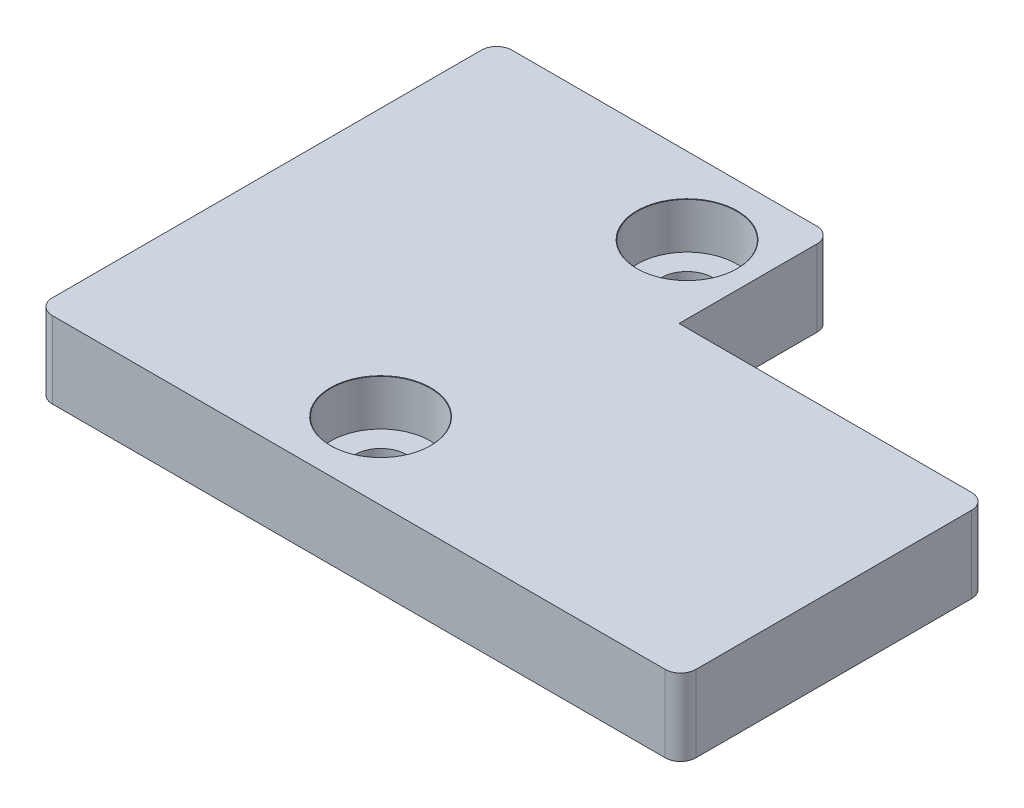
ISO-10303-21;
HEADER;
FILE_DESCRIPTION(('STEP AP214'),'2;1');
FILE_NAME('part.step','',(''),(''),'','','');
FILE_SCHEMA(('AUTOMOTIVE_DESIGN { 1 0 10303 214 1 1 1 1 }'));
ENDSEC;
DATA;
#1=APPLICATION_CONTEXT('core data for automotive mechanical design processes');
#2=APPLICATION_PROTOCOL_DEFINITION('international standard','automotive_design',2000,#1);
#3=PRODUCT_CONTEXT('',#1,'mechanical');
#4=PRODUCT('Part','Part','',(#3));
#5=PRODUCT_RELATED_PRODUCT_CATEGORY('part','',(#4));
#6=PRODUCT_DEFINITION_FORMATION('','',#4);
#7=PRODUCT_DEFINITION_CONTEXT('part definition',#1,'design');
#8=PRODUCT_DEFINITION('design','',#6,#7);
#9=PRODUCT_DEFINITION_SHAPE('','',#8);
#10=(LENGTH_UNIT() NAMED_UNIT(*) SI_UNIT(.MILLI.,.METRE.));
#11=(NAMED_UNIT(*) PLANE_ANGLE_UNIT() SI_UNIT($,.RADIAN.));
#12=(NAMED_UNIT(*) SI_UNIT($,.STERADIAN.) SOLID_ANGLE_UNIT());
#13=UNCERTAINTY_MEASURE_WITH_UNIT(LENGTH_MEASURE(1.E-05),#10,'distance_accuracy_value','');
#14=(GEOMETRIC_REPRESENTATION_CONTEXT(3) GLOBAL_UNCERTAINTY_ASSIGNED_CONTEXT((#13)) GLOBAL_UNIT_ASSIGNED_CONTEXT((#10,
#11,#12)) REPRESENTATION_CONTEXT('',''));
#15=CARTESIAN_POINT('',(0.,0.,0.));
#16=DIRECTION('',(0.,0.,1.));
#17=DIRECTION('',(1.,0.,0.));
#18=AXIS2_PLACEMENT_3D('',#15,#16,#17);
#19=CARTESIAN_POINT('',(-21.,5.,-10.));
#20=DIRECTION('',(1.,0.,0.));
#21=DIRECTION('',(0.,0.,-1.));
#22=AXIS2_PLACEMENT_3D('',#19,#20,#21);
#23=PLANE('',#22);
#24=DIRECTION('',(0.,0.,1.));
#25=VECTOR('',#24,1.);
#26=CARTESIAN_POINT('',(-21.,5.,-10.));
#27=LINE('',#26,#25);
#28=CARTESIAN_POINT('',(-21.,5.,-19.));
#29=VERTEX_POINT('',#28);
#30=CARTESIAN_POINT('',(-21.,5.,9.));
#31=VERTEX_POINT('',#30);
#32=EDGE_CURVE('E138',#29,#31,#27,.T.);
#33=ORIENTED_EDGE('',*,*,#32,.F.);
#34=DIRECTION('',(0.,1.,0.));
#35=VECTOR('',#34,1.);
#36=CARTESIAN_POINT('',(-21.,0.,-19.));
#37=LINE('',#36,#35);
#38=CARTESIAN_POINT('',(-21.,0.,-19.));
#39=VERTEX_POINT('',#38);
#40=EDGE_CURVE('E222',#29,#39,#37,.F.);
#41=ORIENTED_EDGE('',*,*,#40,.T.);
#42=DIRECTION('',(0.,0.,1.));
#43=VECTOR('',#42,1.);
#44=CARTESIAN_POINT('',(-21.,0.,-10.));
#45=LINE('',#44,#43);
#46=CARTESIAN_POINT('',(-21.,0.,9.));
#47=VERTEX_POINT('',#46);
#48=EDGE_CURVE('E151',#39,#47,#45,.T.);
#49=ORIENTED_EDGE('',*,*,#48,.T.);
#50=DIRECTION('',(0.,-1.,0.));
#51=VECTOR('',#50,1.);
#52=CARTESIAN_POINT('',(-21.,5.,9.));
#53=LINE('',#52,#51);
#54=EDGE_CURVE('E219',#47,#31,#53,.F.);
#55=ORIENTED_EDGE('',*,*,#54,.T.);
#56=EDGE_LOOP('',(#33,#41,#49,#55));
#57=FACE_BOUND('',#56,.T.);
#58=ADVANCED_FACE('F43',(#57),#23,.F.);
#59=CARTESIAN_POINT('',(21.,5.,10.));
#60=DIRECTION('',(0.,0.,-1.));
#61=DIRECTION('',(-1.,0.,0.));
#62=AXIS2_PLACEMENT_3D('',#59,#60,#61);
#63=PLANE('',#62);
#64=DIRECTION('',(1.,0.,0.));
#65=VECTOR('',#64,1.);
#66=CARTESIAN_POINT('',(21.,0.,10.));
#67=LINE('',#66,#65);
#68=CARTESIAN_POINT('',(-20.,0.,10.));
#69=VERTEX_POINT('',#68);
#70=CARTESIAN_POINT('',(20.,0.,10.));
#71=VERTEX_POINT('',#70);
#72=EDGE_CURVE('E192',#69,#71,#67,.T.);
#73=ORIENTED_EDGE('',*,*,#72,.T.);
#74=DIRECTION('',(0.,-1.,0.));
#75=VECTOR('',#74,1.);
#76=CARTESIAN_POINT('',(20.,5.,10.));
#77=LINE('',#76,#75);
#78=CARTESIAN_POINT('',(20.,5.,10.));
#79=VERTEX_POINT('',#78);
#80=EDGE_CURVE('E11',#71,#79,#77,.F.);
#81=ORIENTED_EDGE('',*,*,#80,.T.);
#82=DIRECTION('',(1.,0.,0.));
#83=VECTOR('',#82,1.);
#84=CARTESIAN_POINT('',(21.,5.,10.));
#85=LINE('',#84,#83);
#86=CARTESIAN_POINT('',(-20.,5.,10.));
#87=VERTEX_POINT('',#86);
#88=EDGE_CURVE('E177',#87,#79,#85,.T.);
#89=ORIENTED_EDGE('',*,*,#88,.F.);
#90=DIRECTION('',(0.,-1.,0.));
#91=VECTOR('',#90,1.);
#92=CARTESIAN_POINT('',(-20.,5.,10.));
#93=LINE('',#92,#91);
#94=EDGE_CURVE('E52',#87,#69,#93,.T.);
#95=ORIENTED_EDGE('',*,*,#94,.T.);
#96=EDGE_LOOP('',(#73,#81,#89,#95));
#97=FACE_BOUND('',#96,.T.);
#98=ADVANCED_FACE('F251',(#97),#63,.F.);
#99=CARTESIAN_POINT('',(21.,5.,-10.));
#100=DIRECTION('',(-1.,0.,0.));
#101=DIRECTION('',(0.,0.,1.));
#102=AXIS2_PLACEMENT_3D('',#99,#100,#101);
#103=PLANE('',#102);
#104=DIRECTION('',(0.,0.,-1.));
#105=VECTOR('',#104,1.);
#106=CARTESIAN_POINT('',(21.,0.,-10.));
#107=LINE('',#106,#105);
#108=CARTESIAN_POINT('',(21.,0.,9.));
#109=VERTEX_POINT('',#108);
#110=CARTESIAN_POINT('',(21.,0.,-9.));
#111=VERTEX_POINT('',#110);
#112=EDGE_CURVE('E139',#109,#111,#107,.T.);
#113=ORIENTED_EDGE('',*,*,#112,.T.);
#114=DIRECTION('',(0.,-1.,0.));
#115=VECTOR('',#114,1.);
#116=CARTESIAN_POINT('',(21.,5.,-9.));
#117=LINE('',#116,#115);
#118=CARTESIAN_POINT('',(21.,5.,-9.));
#119=VERTEX_POINT('',#118);
#120=EDGE_CURVE('E246',#111,#119,#117,.F.);
#121=ORIENTED_EDGE('',*,*,#120,.T.);
#122=DIRECTION('',(0.,0.,-1.));
#123=VECTOR('',#122,1.);
#124=CARTESIAN_POINT('',(21.,5.,-10.));
#125=LINE('',#124,#123);
#126=CARTESIAN_POINT('',(21.,5.,9.));
#127=VERTEX_POINT('',#126);
#128=EDGE_CURVE('E181',#127,#119,#125,.T.);
#129=ORIENTED_EDGE('',*,*,#128,.F.);
#130=DIRECTION('',(0.,-1.,0.));
#131=VECTOR('',#130,1.);
#132=CARTESIAN_POINT('',(21.,5.,9.));
#133=LINE('',#132,#131);
#134=EDGE_CURVE('E242',#127,#109,#133,.T.);
#135=ORIENTED_EDGE('',*,*,#134,.T.);
#136=EDGE_LOOP('',(#113,#121,#129,#135));
#137=FACE_BOUND('',#136,.T.);
#138=ADVANCED_FACE('F275',(#137),#103,.F.);
#139=CARTESIAN_POINT('',(21.,5.,-10.));
#140=DIRECTION('',(0.,0.,1.));
#141=DIRECTION('',(1.,0.,0.));
#142=AXIS2_PLACEMENT_3D('',#139,#140,#141);
#143=PLANE('',#142);
#144=DIRECTION('',(-1.,0.,0.));
#145=VECTOR('',#144,1.);
#146=CARTESIAN_POINT('',(21.,5.,-10.));
#147=LINE('',#146,#145);
#148=CARTESIAN_POINT('',(20.,5.,-10.));
#149=VERTEX_POINT('',#148);
#150=CARTESIAN_POINT('',(0.900000000000001,5.,-10.));
#151=VERTEX_POINT('',#150);
#152=EDGE_CURVE('E185',#149,#151,#147,.T.);
#153=ORIENTED_EDGE('',*,*,#152,.F.);
#154=DIRECTION('',(0.,-1.,0.));
#155=VECTOR('',#154,1.);
#156=CARTESIAN_POINT('',(20.,5.,-10.));
#157=LINE('',#156,#155);
#158=CARTESIAN_POINT('',(20.,0.,-10.));
#159=VERTEX_POINT('',#158);
#160=EDGE_CURVE('E135',#149,#159,#157,.T.);
#161=ORIENTED_EDGE('',*,*,#160,.T.);
#162=DIRECTION('',(-1.,0.,0.));
#163=VECTOR('',#162,1.);
#164=CARTESIAN_POINT('',(21.,0.,-10.));
#165=LINE('',#164,#163);
#166=CARTESIAN_POINT('',(0.900000000000001,0.,-10.));
#167=VERTEX_POINT('',#166);
#168=EDGE_CURVE('E129',#159,#167,#165,.T.);
#169=ORIENTED_EDGE('',*,*,#168,.T.);
#170=DIRECTION('',(0.,1.,0.));
#171=VECTOR('',#170,1.);
#172=CARTESIAN_POINT('',(0.900000000000001,0.,-10.));
#173=LINE('',#172,#171);
#174=EDGE_CURVE('E133',#167,#151,#173,.T.);
#175=ORIENTED_EDGE('',*,*,#174,.T.);
#176=EDGE_LOOP('',(#153,#161,#169,#175));
#177=FACE_BOUND('',#176,.T.);
#178=ADVANCED_FACE('F132',(#177),#143,.F.);
#179=CARTESIAN_POINT('',(0.,5.,0.));
#180=DIRECTION('',(0.,-1.,0.));
#181=DIRECTION('',(0.,0.,-1.));
#182=AXIS2_PLACEMENT_3D('',#179,#180,#181);
#183=PLANE('',#182);
#184=CARTESIAN_POINT('',(-3.575,5.,-15.));
#185=DIRECTION('',(0.,1.,0.));
#186=DIRECTION('',(0.,0.,1.));
#187=AXIS2_PLACEMENT_3D('',#184,#185,#186);
#188=CIRCLE('',#187,3.275);
#189=CARTESIAN_POINT('',(-3.575,5.,-11.725));
#190=VERTEX_POINT('',#189);
#191=EDGE_CURVE('E518',#190,#190,#188,.T.);
#192=ORIENTED_EDGE('',*,*,#191,.F.);
#193=EDGE_LOOP('',(#192));
#194=FACE_BOUND('',#193,.T.);
#195=CARTESIAN_POINT('',(-3.57499999999999,5.,5.));
#196=DIRECTION('',(0.,1.,0.));
#197=DIRECTION('',(0.,0.,1.));
#198=AXIS2_PLACEMENT_3D('',#195,#196,#197);
#199=CIRCLE('',#198,3.275);
#200=CARTESIAN_POINT('',(-3.57499999999999,5.,8.275));
#201=VERTEX_POINT('',#200);
#202=EDGE_CURVE('E521',#201,#201,#199,.T.);
#203=ORIENTED_EDGE('',*,*,#202,.F.);
#204=EDGE_LOOP('',(#203));
#205=FACE_BOUND('',#204,.T.);
#206=DIRECTION('',(-1.,0.,0.));
#207=VECTOR('',#206,1.);
#208=CARTESIAN_POINT('',(-21.,5.,-20.));
#209=LINE('',#208,#207);
#210=CARTESIAN_POINT('',(-0.0999999999999994,5.,-20.));
#211=VERTEX_POINT('',#210);
#212=CARTESIAN_POINT('',(-20.,5.,-20.));
#213=VERTEX_POINT('',#212);
#214=EDGE_CURVE('E160',#211,#213,#209,.T.);
#215=ORIENTED_EDGE('',*,*,#214,.T.);
#216=CARTESIAN_POINT('',(-20.,5.,-19.));
#217=DIRECTION('',(0.,-1.,0.));
#218=DIRECTION('',(0.,0.,-1.));
#219=AXIS2_PLACEMENT_3D('',#216,#217,#218);
#220=CIRCLE('',#219,1.);
#221=EDGE_CURVE('E216',#213,#29,#220,.F.);
#222=ORIENTED_EDGE('',*,*,#221,.T.);
#223=ORIENTED_EDGE('',*,*,#32,.T.);
#224=CARTESIAN_POINT('',(-20.,5.,9.));
#225=DIRECTION('',(0.,-1.,0.));
#226=DIRECTION('',(0.,0.,-1.));
#227=AXIS2_PLACEMENT_3D('',#224,#225,#226);
#228=CIRCLE('',#227,1.);
#229=EDGE_CURVE('E204',#31,#87,#228,.F.);
#230=ORIENTED_EDGE('',*,*,#229,.T.);
#231=ORIENTED_EDGE('',*,*,#88,.T.);
#232=CARTESIAN_POINT('',(20.,5.,9.));
#233=DIRECTION('',(0.,-1.,0.));
#234=DIRECTION('',(0.,0.,-1.));
#235=AXIS2_PLACEMENT_3D('',#232,#233,#234);
#236=CIRCLE('',#235,1.);
#237=EDGE_CURVE('E207',#79,#127,#236,.F.);
#238=ORIENTED_EDGE('',*,*,#237,.T.);
#239=ORIENTED_EDGE('',*,*,#128,.T.);
#240=CARTESIAN_POINT('',(20.,5.,-9.));
#241=DIRECTION('',(0.,-1.,0.));
#242=DIRECTION('',(0.,0.,-1.));
#243=AXIS2_PLACEMENT_3D('',#240,#241,#242);
#244=CIRCLE('',#243,1.);
#245=EDGE_CURVE('E210',#119,#149,#244,.F.);
#246=ORIENTED_EDGE('',*,*,#245,.T.);
#247=ORIENTED_EDGE('',*,*,#152,.T.);
#248=DIRECTION('',(0.,0.,-1.));
#249=VECTOR('',#248,1.);
#250=CARTESIAN_POINT('',(0.900000000000001,5.,-10.));
#251=LINE('',#250,#249);
#252=CARTESIAN_POINT('',(0.900000000000001,5.,-19.));
#253=VERTEX_POINT('',#252);
#254=EDGE_CURVE('E149',#151,#253,#251,.T.);
#255=ORIENTED_EDGE('',*,*,#254,.T.);
#256=CARTESIAN_POINT('',(-0.0999999999999985,5.,-19.));
#257=DIRECTION('',(0.,-1.,0.));
#258=DIRECTION('',(0.,0.,-1.));
#259=AXIS2_PLACEMENT_3D('',#256,#257,#258);
#260=CIRCLE('',#259,1.);
#261=EDGE_CURVE('E213',#253,#211,#260,.F.);
#262=ORIENTED_EDGE('',*,*,#261,.T.);
#263=EDGE_LOOP('',(#215,#222,#223,#230,#231,#238,#239,#246,#247,#255,#262));
#264=FACE_BOUND('',#263,.T.);
#265=ADVANCED_FACE('F259',(#194,#205,#264),#183,.F.);
#266=CARTESIAN_POINT('',(0.,0.,0.));
#267=DIRECTION('',(0.,-1.,0.));
#268=DIRECTION('',(0.,0.,-1.));
#269=AXIS2_PLACEMENT_3D('',#266,#267,#268);
#270=PLANE('',#269);
#271=CARTESIAN_POINT('',(-3.575,0.,-15.));
#272=DIRECTION('',(0.,1.,0.));
#273=DIRECTION('',(0.,0.,1.));
#274=AXIS2_PLACEMENT_3D('',#271,#272,#273);
#275=CIRCLE('',#274,1.7);
#276=CARTESIAN_POINT('',(-3.575,0.,-13.3));
#277=VERTEX_POINT('',#276);
#278=EDGE_CURVE('E525',#277,#277,#275,.T.);
#279=ORIENTED_EDGE('',*,*,#278,.T.);
#280=EDGE_LOOP('',(#279));
#281=FACE_BOUND('',#280,.T.);
#282=CARTESIAN_POINT('',(-3.57499999999999,0.,5.));
#283=DIRECTION('',(0.,1.,0.));
#284=DIRECTION('',(0.,0.,1.));
#285=AXIS2_PLACEMENT_3D('',#282,#283,#284);
#286=CIRCLE('',#285,1.7);
#287=CARTESIAN_POINT('',(-3.57499999999999,0.,6.7));
#288=VERTEX_POINT('',#287);
#289=EDGE_CURVE('E169',#288,#288,#286,.T.);
#290=ORIENTED_EDGE('',*,*,#289,.T.);
#291=EDGE_LOOP('',(#290));
#292=FACE_BOUND('',#291,.T.);
#293=ORIENTED_EDGE('',*,*,#48,.F.);
#294=CARTESIAN_POINT('',(-20.,0.,-19.));
#295=DIRECTION('',(0.,-1.,0.));
#296=DIRECTION('',(0.,0.,-1.));
#297=AXIS2_PLACEMENT_3D('',#294,#295,#296);
#298=CIRCLE('',#297,1.);
#299=CARTESIAN_POINT('',(-20.,0.,-20.));
#300=VERTEX_POINT('',#299);
#301=EDGE_CURVE('E234',#39,#300,#298,.T.);
#302=ORIENTED_EDGE('',*,*,#301,.T.);
#303=DIRECTION('',(-1.,0.,0.));
#304=VECTOR('',#303,1.);
#305=CARTESIAN_POINT('',(-21.,0.,-20.));
#306=LINE('',#305,#304);
#307=CARTESIAN_POINT('',(-0.0999999999999994,0.,-20.));
#308=VERTEX_POINT('',#307);
#309=EDGE_CURVE('E152',#308,#300,#306,.T.);
#310=ORIENTED_EDGE('',*,*,#309,.F.);
#311=CARTESIAN_POINT('',(-0.0999999999999985,0.,-19.));
#312=DIRECTION('',(0.,-1.,0.));
#313=DIRECTION('',(0.,0.,-1.));
#314=AXIS2_PLACEMENT_3D('',#311,#312,#313);
#315=CIRCLE('',#314,1.);
#316=CARTESIAN_POINT('',(0.900000000000001,0.,-19.));
#317=VERTEX_POINT('',#316);
#318=EDGE_CURVE('E158',#308,#317,#315,.T.);
#319=ORIENTED_EDGE('',*,*,#318,.T.);
#320=DIRECTION('',(0.,0.,-1.));
#321=VECTOR('',#320,1.);
#322=CARTESIAN_POINT('',(0.900000000000001,0.,-10.));
#323=LINE('',#322,#321);
#324=EDGE_CURVE('E146',#167,#317,#323,.T.);
#325=ORIENTED_EDGE('',*,*,#324,.F.);
#326=ORIENTED_EDGE('',*,*,#168,.F.);
#327=CARTESIAN_POINT('',(20.,0.,-9.));
#328=DIRECTION('',(0.,-1.,0.));
#329=DIRECTION('',(0.,0.,-1.));
#330=AXIS2_PLACEMENT_3D('',#327,#328,#329);
#331=CIRCLE('',#330,1.);
#332=EDGE_CURVE('E229',#159,#111,#331,.T.);
#333=ORIENTED_EDGE('',*,*,#332,.T.);
#334=ORIENTED_EDGE('',*,*,#112,.F.);
#335=CARTESIAN_POINT('',(20.,0.,9.));
#336=DIRECTION('',(0.,-1.,0.));
#337=DIRECTION('',(0.,0.,-1.));
#338=AXIS2_PLACEMENT_3D('',#335,#336,#337);
#339=CIRCLE('',#338,1.);
#340=EDGE_CURVE('E59',#109,#71,#339,.T.);
#341=ORIENTED_EDGE('',*,*,#340,.T.);
#342=ORIENTED_EDGE('',*,*,#72,.F.);
#343=CARTESIAN_POINT('',(-20.,0.,9.));
#344=DIRECTION('',(0.,-1.,0.));
#345=DIRECTION('',(0.,0.,-1.));
#346=AXIS2_PLACEMENT_3D('',#343,#344,#345);
#347=CIRCLE('',#346,1.);
#348=EDGE_CURVE('E67',#69,#47,#347,.T.);
#349=ORIENTED_EDGE('',*,*,#348,.T.);
#350=EDGE_LOOP('',(#293,#302,#310,#319,#325,#326,#333,#334,#341,#342,#349));
#351=FACE_BOUND('',#350,.T.);
#352=ADVANCED_FACE('F155',(#281,#292,#351),#270,.T.);
#353=CARTESIAN_POINT('',(-21.,0.,-20.));
#354=DIRECTION('',(0.,0.,-1.));
#355=DIRECTION('',(-1.,0.,0.));
#356=AXIS2_PLACEMENT_3D('',#353,#354,#355);
#357=PLANE('',#356);
#358=ORIENTED_EDGE('',*,*,#309,.T.);
#359=DIRECTION('',(0.,1.,0.));
#360=VECTOR('',#359,1.);
#361=CARTESIAN_POINT('',(-20.,5.,-20.));
#362=LINE('',#361,#360);
#363=EDGE_CURVE('E200',#300,#213,#362,.T.);
#364=ORIENTED_EDGE('',*,*,#363,.T.);
#365=ORIENTED_EDGE('',*,*,#214,.F.);
#366=DIRECTION('',(0.,1.,0.));
#367=VECTOR('',#366,1.);
#368=CARTESIAN_POINT('',(-0.0999999999999994,0.,-20.));
#369=LINE('',#368,#367);
#370=EDGE_CURVE('E188',#211,#308,#369,.F.);
#371=ORIENTED_EDGE('',*,*,#370,.T.);
#372=EDGE_LOOP('',(#358,#364,#365,#371));
#373=FACE_BOUND('',#372,.T.);
#374=ADVANCED_FACE('F265',(#373),#357,.T.);
#375=CARTESIAN_POINT('',(0.900000000000001,0.,-10.));
#376=DIRECTION('',(1.,0.,0.));
#377=DIRECTION('',(0.,0.,-1.));
#378=AXIS2_PLACEMENT_3D('',#375,#376,#377);
#379=PLANE('',#378);
#380=ORIENTED_EDGE('',*,*,#324,.T.);
#381=DIRECTION('',(0.,1.,0.));
#382=VECTOR('',#381,1.);
#383=CARTESIAN_POINT('',(0.900000000000001,0.,-19.));
#384=LINE('',#383,#382);
#385=EDGE_CURVE('E237',#317,#253,#384,.T.);
#386=ORIENTED_EDGE('',*,*,#385,.T.);
#387=ORIENTED_EDGE('',*,*,#254,.F.);
#388=ORIENTED_EDGE('',*,*,#174,.F.);
#389=EDGE_LOOP('',(#380,#386,#387,#388));
#390=FACE_BOUND('',#389,.T.);
#391=ADVANCED_FACE('F144',(#390),#379,.T.);
#392=CARTESIAN_POINT('',(-3.57499999999999,5.,5.));
#393=DIRECTION('',(0.,1.,0.));
#394=DIRECTION('',(0.,0.,1.));
#395=AXIS2_PLACEMENT_3D('',#392,#393,#394);
#396=CYLINDRICAL_SURFACE('',#395,1.7);
#397=ORIENTED_EDGE('',*,*,#289,.F.);
#398=EDGE_LOOP('',(#397));
#399=FACE_BOUND('',#398,.T.);
#400=CARTESIAN_POINT('',(-3.57499999999999,2.,5.));
#401=DIRECTION('',(0.,1.,0.));
#402=DIRECTION('',(0.,0.,1.));
#403=AXIS2_PLACEMENT_3D('',#400,#401,#402);
#404=CIRCLE('',#403,1.7);
#405=CARTESIAN_POINT('',(-3.57499999999999,2.,6.7));
#406=VERTEX_POINT('',#405);
#407=EDGE_CURVE('E539',#406,#406,#404,.T.);
#408=ORIENTED_EDGE('',*,*,#407,.T.);
#409=EDGE_LOOP('',(#408));
#410=FACE_BOUND('',#409,.T.);
#411=ADVANCED_FACE('F400',(#399,#410),#396,.F.);
#412=CARTESIAN_POINT('',(-0.324999999999995,2.,5.));
#413=DIRECTION('',(0.,-1.,0.));
#414=DIRECTION('',(0.,0.,-1.));
#415=AXIS2_PLACEMENT_3D('',#412,#413,#414);
#416=PLANE('',#415);
#417=ORIENTED_EDGE('',*,*,#407,.F.);
#418=EDGE_LOOP('',(#417));
#419=FACE_BOUND('',#418,.T.);
#420=CARTESIAN_POINT('',(-3.57499999999999,2.,5.));
#421=DIRECTION('',(0.,1.,0.));
#422=DIRECTION('',(0.,0.,1.));
#423=AXIS2_PLACEMENT_3D('',#420,#421,#422);
#424=CIRCLE('',#423,3.25);
#425=CARTESIAN_POINT('',(-3.57499999999999,2.,8.25));
#426=VERTEX_POINT('',#425);
#427=EDGE_CURVE('E530',#426,#426,#424,.T.);
#428=ORIENTED_EDGE('',*,*,#427,.T.);
#429=EDGE_LOOP('',(#428));
#430=FACE_BOUND('',#429,.T.);
#431=ADVANCED_FACE('F390',(#419,#430),#416,.F.);
#432=CARTESIAN_POINT('',(-3.57499999999999,5.,5.));
#433=DIRECTION('',(0.,1.,0.));
#434=DIRECTION('',(0.,0.,1.));
#435=AXIS2_PLACEMENT_3D('',#432,#433,#434);
#436=CYLINDRICAL_SURFACE('',#435,3.25);
#437=ORIENTED_EDGE('',*,*,#427,.F.);
#438=EDGE_LOOP('',(#437));
#439=FACE_BOUND('',#438,.T.);
#440=CARTESIAN_POINT('',(-3.57499999999999,4.97902250922057,5.));
#441=DIRECTION('',(0.,1.,0.));
#442=DIRECTION('',(0.,0.,1.));
#443=AXIS2_PLACEMENT_3D('',#440,#441,#442);
#444=CIRCLE('',#443,3.25);
#445=CARTESIAN_POINT('',(-3.57499999999999,4.97902250922057,8.25));
#446=VERTEX_POINT('',#445);
#447=EDGE_CURVE('E524',#446,#446,#444,.T.);
#448=ORIENTED_EDGE('',*,*,#447,.T.);
#449=EDGE_LOOP('',(#448));
#450=FACE_BOUND('',#449,.T.);
#451=ADVANCED_FACE('F380',(#439,#450),#436,.F.);
#452=CARTESIAN_POINT('',(-3.57499999999999,5.,5.));
#453=DIRECTION('',(0.,1.,0.));
#454=DIRECTION('',(0.,0.,1.));
#455=AXIS2_PLACEMENT_3D('',#452,#453,#454);
#456=CONICAL_SURFACE('',#455,3.275,0.87266462599717);
#457=ORIENTED_EDGE('',*,*,#447,.F.);
#458=EDGE_LOOP('',(#457));
#459=FACE_BOUND('',#458,.T.);
#460=ORIENTED_EDGE('',*,*,#202,.T.);
#461=EDGE_LOOP('',(#460));
#462=FACE_BOUND('',#461,.T.);
#463=ADVANCED_FACE('F370',(#459,#462),#456,.F.);
#464=CARTESIAN_POINT('',(-3.575,5.,-15.));
#465=DIRECTION('',(0.,1.,0.));
#466=DIRECTION('',(0.,0.,1.));
#467=AXIS2_PLACEMENT_3D('',#464,#465,#466);
#468=CYLINDRICAL_SURFACE('',#467,1.7);
#469=ORIENTED_EDGE('',*,*,#278,.F.);
#470=EDGE_LOOP('',(#469));
#471=FACE_BOUND('',#470,.T.);
#472=CARTESIAN_POINT('',(-3.575,2.,-15.));
#473=DIRECTION('',(0.,1.,0.));
#474=DIRECTION('',(0.,0.,1.));
#475=AXIS2_PLACEMENT_3D('',#472,#473,#474);
#476=CIRCLE('',#475,1.7);
#477=CARTESIAN_POINT('',(-3.575,2.,-13.3));
#478=VERTEX_POINT('',#477);
#479=EDGE_CURVE('E533',#478,#478,#476,.T.);
#480=ORIENTED_EDGE('',*,*,#479,.T.);
#481=EDGE_LOOP('',(#480));
#482=FACE_BOUND('',#481,.T.);
#483=ADVANCED_FACE('F360',(#471,#482),#468,.F.);
#484=CARTESIAN_POINT('',(-0.325000000000001,2.,-15.));
#485=DIRECTION('',(0.,-1.,0.));
#486=DIRECTION('',(0.,0.,-1.));
#487=AXIS2_PLACEMENT_3D('',#484,#485,#486);
#488=PLANE('',#487);
#489=ORIENTED_EDGE('',*,*,#479,.F.);
#490=EDGE_LOOP('',(#489));
#491=FACE_BOUND('',#490,.T.);
#492=CARTESIAN_POINT('',(-3.575,2.,-15.));
#493=DIRECTION('',(0.,1.,0.));
#494=DIRECTION('',(0.,0.,1.));
#495=AXIS2_PLACEMENT_3D('',#492,#493,#494);
#496=CIRCLE('',#495,3.25);
#497=CARTESIAN_POINT('',(-3.575,2.,-11.75));
#498=VERTEX_POINT('',#497);
#499=EDGE_CURVE('E555',#498,#498,#496,.T.);
#500=ORIENTED_EDGE('',*,*,#499,.T.);
#501=EDGE_LOOP('',(#500));
#502=FACE_BOUND('',#501,.T.);
#503=ADVANCED_FACE('F350',(#491,#502),#488,.F.);
#504=CARTESIAN_POINT('',(-3.575,5.,-15.));
#505=DIRECTION('',(0.,1.,0.));
#506=DIRECTION('',(0.,0.,1.));
#507=AXIS2_PLACEMENT_3D('',#504,#505,#506);
#508=CYLINDRICAL_SURFACE('',#507,3.25);
#509=ORIENTED_EDGE('',*,*,#499,.F.);
#510=EDGE_LOOP('',(#509));
#511=FACE_BOUND('',#510,.T.);
#512=CARTESIAN_POINT('',(-3.575,4.97902250922057,-15.));
#513=DIRECTION('',(0.,1.,0.));
#514=DIRECTION('',(0.,0.,1.));
#515=AXIS2_PLACEMENT_3D('',#512,#513,#514);
#516=CIRCLE('',#515,3.25);
#517=CARTESIAN_POINT('',(-3.575,4.97902250922057,-11.75));
#518=VERTEX_POINT('',#517);
#519=EDGE_CURVE('E559',#518,#518,#516,.T.);
#520=ORIENTED_EDGE('',*,*,#519,.T.);
#521=EDGE_LOOP('',(#520));
#522=FACE_BOUND('',#521,.T.);
#523=ADVANCED_FACE('F340',(#511,#522),#508,.F.);
#524=CARTESIAN_POINT('',(-3.575,5.,-15.));
#525=DIRECTION('',(0.,1.,0.));
#526=DIRECTION('',(0.,0.,1.));
#527=AXIS2_PLACEMENT_3D('',#524,#525,#526);
#528=CONICAL_SURFACE('',#527,3.275,0.87266462599717);
#529=ORIENTED_EDGE('',*,*,#519,.F.);
#530=EDGE_LOOP('',(#529));
#531=FACE_BOUND('',#530,.T.);
#532=ORIENTED_EDGE('',*,*,#191,.T.);
#533=EDGE_LOOP('',(#532));
#534=FACE_BOUND('',#533,.T.);
#535=ADVANCED_FACE('F296',(#531,#534),#528,.F.);
#536=CARTESIAN_POINT('',(-20.,0.,-19.));
#537=DIRECTION('',(0.,-1.,0.));
#538=DIRECTION('',(0.,0.,-1.));
#539=AXIS2_PLACEMENT_3D('',#536,#537,#538);
#540=CYLINDRICAL_SURFACE('',#539,1.);
#541=ORIENTED_EDGE('',*,*,#301,.F.);
#542=ORIENTED_EDGE('',*,*,#40,.F.);
#543=ORIENTED_EDGE('',*,*,#221,.F.);
#544=ORIENTED_EDGE('',*,*,#363,.F.);
#545=EDGE_LOOP('',(#541,#542,#543,#544));
#546=FACE_BOUND('',#545,.T.);
#547=ADVANCED_FACE('F262',(#546),#540,.T.);
#548=CARTESIAN_POINT('',(-0.0999999999999985,0.,-19.));
#549=DIRECTION('',(0.,1.,0.));
#550=DIRECTION('',(0.,0.,1.));
#551=AXIS2_PLACEMENT_3D('',#548,#549,#550);
#552=CYLINDRICAL_SURFACE('',#551,1.);
#553=ORIENTED_EDGE('',*,*,#318,.F.);
#554=ORIENTED_EDGE('',*,*,#370,.F.);
#555=ORIENTED_EDGE('',*,*,#261,.F.);
#556=ORIENTED_EDGE('',*,*,#385,.F.);
#557=EDGE_LOOP('',(#553,#554,#555,#556));
#558=FACE_BOUND('',#557,.T.);
#559=ADVANCED_FACE('F269',(#558),#552,.T.);
#560=CARTESIAN_POINT('',(20.,5.,-9.));
#561=DIRECTION('',(0.,-1.,0.));
#562=DIRECTION('',(0.,0.,-1.));
#563=AXIS2_PLACEMENT_3D('',#560,#561,#562);
#564=CYLINDRICAL_SURFACE('',#563,1.);
#565=ORIENTED_EDGE('',*,*,#245,.F.);
#566=ORIENTED_EDGE('',*,*,#120,.F.);
#567=ORIENTED_EDGE('',*,*,#332,.F.);
#568=ORIENTED_EDGE('',*,*,#160,.F.);
#569=EDGE_LOOP('',(#565,#566,#567,#568));
#570=FACE_BOUND('',#569,.T.);
#571=ADVANCED_FACE('F272',(#570),#564,.T.);
#572=CARTESIAN_POINT('',(20.,5.,9.));
#573=DIRECTION('',(0.,-1.,0.));
#574=DIRECTION('',(0.,0.,-1.));
#575=AXIS2_PLACEMENT_3D('',#572,#573,#574);
#576=CYLINDRICAL_SURFACE('',#575,1.);
#577=ORIENTED_EDGE('',*,*,#237,.F.);
#578=ORIENTED_EDGE('',*,*,#80,.F.);
#579=ORIENTED_EDGE('',*,*,#340,.F.);
#580=ORIENTED_EDGE('',*,*,#134,.F.);
#581=EDGE_LOOP('',(#577,#578,#579,#580));
#582=FACE_BOUND('',#581,.T.);
#583=ADVANCED_FACE('F279',(#582),#576,.T.);
#584=CARTESIAN_POINT('',(-20.,5.,9.));
#585=DIRECTION('',(0.,-1.,0.));
#586=DIRECTION('',(0.,0.,-1.));
#587=AXIS2_PLACEMENT_3D('',#584,#585,#586);
#588=CYLINDRICAL_SURFACE('',#587,1.);
#589=ORIENTED_EDGE('',*,*,#229,.F.);
#590=ORIENTED_EDGE('',*,*,#54,.F.);
#591=ORIENTED_EDGE('',*,*,#348,.F.);
#592=ORIENTED_EDGE('',*,*,#94,.F.);
#593=EDGE_LOOP('',(#589,#590,#591,#592));
#594=FACE_BOUND('',#593,.T.);
#595=ADVANCED_FACE('F45',(#594),#588,.T.);
#596=CLOSED_SHELL('',(#58,#98,#138,#178,#265,#352,#374,#391,#411,#431,#451,#463,#483,#503,#523,
#535,#547,#559,#571,#583,#595));
#597=MANIFOLD_SOLID_BREP('B2',#596);
#598=ADVANCED_BREP_SHAPE_REPRESENTATION('',(#18,#597),#14);
#599=SHAPE_DEFINITION_REPRESENTATION(#9,#598);
ENDSEC;
END-ISO-10303-21;
